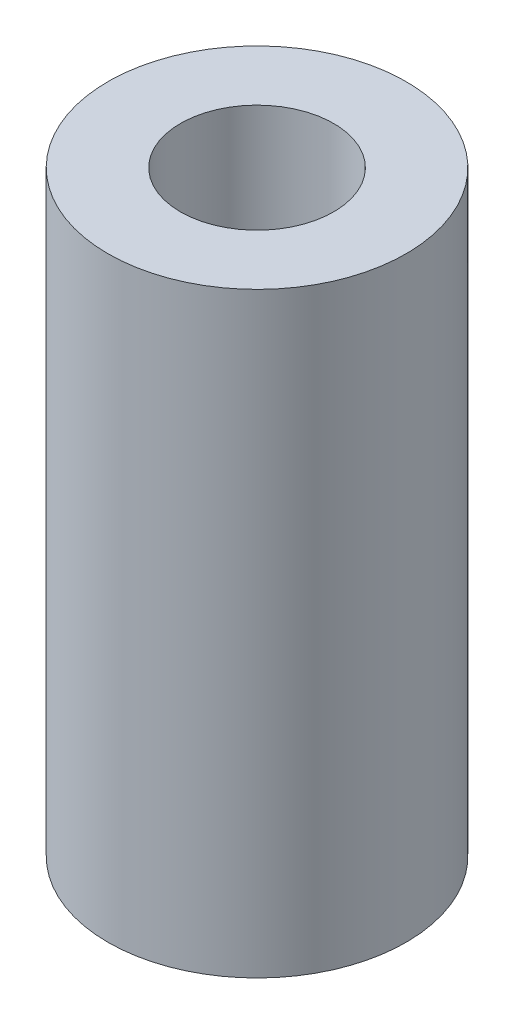
ISO-10303-21;
HEADER;
FILE_DESCRIPTION(('STEP AP214'),'2;1');
FILE_NAME('part.step','',(''),(''),'','','');
FILE_SCHEMA(('AUTOMOTIVE_DESIGN { 1 0 10303 214 1 1 1 1 }'));
ENDSEC;
DATA;
#1=APPLICATION_CONTEXT('core data for automotive mechanical design processes');
#2=APPLICATION_PROTOCOL_DEFINITION('international standard','automotive_design',2000,#1);
#3=PRODUCT_CONTEXT('',#1,'mechanical');
#4=PRODUCT('Part','Part','',(#3));
#5=PRODUCT_RELATED_PRODUCT_CATEGORY('part','',(#4));
#6=PRODUCT_DEFINITION_FORMATION('','',#4);
#7=PRODUCT_DEFINITION_CONTEXT('part definition',#1,'design');
#8=PRODUCT_DEFINITION('design','',#6,#7);
#9=PRODUCT_DEFINITION_SHAPE('','',#8);
#10=(LENGTH_UNIT() NAMED_UNIT(*) SI_UNIT(.MILLI.,.METRE.));
#11=(NAMED_UNIT(*) PLANE_ANGLE_UNIT() SI_UNIT($,.RADIAN.));
#12=(NAMED_UNIT(*) SI_UNIT($,.STERADIAN.) SOLID_ANGLE_UNIT());
#13=UNCERTAINTY_MEASURE_WITH_UNIT(LENGTH_MEASURE(1.E-05),#10,'distance_accuracy_value','');
#14=(GEOMETRIC_REPRESENTATION_CONTEXT(3) GLOBAL_UNCERTAINTY_ASSIGNED_CONTEXT((#13)) GLOBAL_UNIT_ASSIGNED_CONTEXT((#10,
#11,#12)) REPRESENTATION_CONTEXT('',''));
#15=CARTESIAN_POINT('',(0.,0.,0.));
#16=DIRECTION('',(0.,0.,1.));
#17=DIRECTION('',(1.,0.,0.));
#18=AXIS2_PLACEMENT_3D('',#15,#16,#17);
#19=CARTESIAN_POINT('',(0.,25.4,0.));
#20=DIRECTION('',(0.,1.,0.));
#21=DIRECTION('',(0.,0.,1.));
#22=AXIS2_PLACEMENT_3D('',#19,#20,#21);
#23=PLANE('',#22);
#24=CARTESIAN_POINT('',(0.,25.4,0.));
#25=DIRECTION('',(0.,1.,0.));
#26=DIRECTION('',(0.,0.,1.));
#27=AXIS2_PLACEMENT_3D('',#24,#25,#26);
#28=CIRCLE('',#27,6.35);
#29=CARTESIAN_POINT('',(0.,25.4,6.35));
#30=VERTEX_POINT('',#29);
#31=EDGE_CURVE('E10',#30,#30,#28,.T.);
#32=ORIENTED_EDGE('',*,*,#31,.T.);
#33=EDGE_LOOP('',(#32));
#34=FACE_BOUND('',#33,.T.);
#35=CARTESIAN_POINT('',(0.,25.4,0.));
#36=DIRECTION('',(0.,1.,0.));
#37=DIRECTION('',(0.,0.,1.));
#38=AXIS2_PLACEMENT_3D('',#35,#36,#37);
#39=CIRCLE('',#38,3.2639);
#40=CARTESIAN_POINT('',(0.,25.4,3.2639));
#41=VERTEX_POINT('',#40);
#42=EDGE_CURVE('E44',#41,#41,#39,.T.);
#43=ORIENTED_EDGE('',*,*,#42,.F.);
#44=EDGE_LOOP('',(#43));
#45=FACE_BOUND('',#44,.T.);
#46=ADVANCED_FACE('F33',(#34,#45),#23,.T.);
#47=CARTESIAN_POINT('',(0.,0.,0.));
#48=DIRECTION('',(0.,1.,0.));
#49=DIRECTION('',(0.,0.,1.));
#50=AXIS2_PLACEMENT_3D('',#47,#48,#49);
#51=PLANE('',#50);
#52=CARTESIAN_POINT('',(0.,0.,0.));
#53=DIRECTION('',(0.,1.,0.));
#54=DIRECTION('',(0.,0.,1.));
#55=AXIS2_PLACEMENT_3D('',#52,#53,#54);
#56=CIRCLE('',#55,6.35);
#57=CARTESIAN_POINT('',(0.,0.,6.35));
#58=VERTEX_POINT('',#57);
#59=EDGE_CURVE('E37',#58,#58,#56,.T.);
#60=ORIENTED_EDGE('',*,*,#59,.F.);
#61=EDGE_LOOP('',(#60));
#62=FACE_BOUND('',#61,.T.);
#63=CARTESIAN_POINT('',(0.,0.,0.));
#64=DIRECTION('',(0.,1.,0.));
#65=DIRECTION('',(0.,0.,1.));
#66=AXIS2_PLACEMENT_3D('',#63,#64,#65);
#67=CIRCLE('',#66,3.2639);
#68=CARTESIAN_POINT('',(0.,0.,3.2639));
#69=VERTEX_POINT('',#68);
#70=EDGE_CURVE('E46',#69,#69,#67,.T.);
#71=ORIENTED_EDGE('',*,*,#70,.T.);
#72=EDGE_LOOP('',(#71));
#73=FACE_BOUND('',#72,.T.);
#74=ADVANCED_FACE('F56',(#62,#73),#51,.F.);
#75=CARTESIAN_POINT('',(0.,25.4,0.));
#76=DIRECTION('',(0.,-1.,0.));
#77=DIRECTION('',(0.,0.,-1.));
#78=AXIS2_PLACEMENT_3D('',#75,#76,#77);
#79=CYLINDRICAL_SURFACE('',#78,6.35);
#80=ORIENTED_EDGE('',*,*,#31,.F.);
#81=EDGE_LOOP('',(#80));
#82=FACE_BOUND('',#81,.T.);
#83=ORIENTED_EDGE('',*,*,#59,.T.);
#84=EDGE_LOOP('',(#83));
#85=FACE_BOUND('',#84,.T.);
#86=ADVANCED_FACE('F35',(#82,#85),#79,.T.);
#87=CARTESIAN_POINT('',(0.,25.4,0.));
#88=DIRECTION('',(0.,-1.,0.));
#89=DIRECTION('',(0.,0.,-1.));
#90=AXIS2_PLACEMENT_3D('',#87,#88,#89);
#91=CYLINDRICAL_SURFACE('',#90,3.2639);
#92=ORIENTED_EDGE('',*,*,#42,.T.);
#93=EDGE_LOOP('',(#92));
#94=FACE_BOUND('',#93,.T.);
#95=ORIENTED_EDGE('',*,*,#70,.F.);
#96=EDGE_LOOP('',(#95));
#97=FACE_BOUND('',#96,.T.);
#98=ADVANCED_FACE('F52',(#94,#97),#91,.F.);
#99=CLOSED_SHELL('',(#46,#74,#86,#98));
#100=MANIFOLD_SOLID_BREP('B2',#99);
#101=ADVANCED_BREP_SHAPE_REPRESENTATION('',(#18,#100),#14);
#102=SHAPE_DEFINITION_REPRESENTATION(#9,#101);
ENDSEC;
END-ISO-10303-21;
